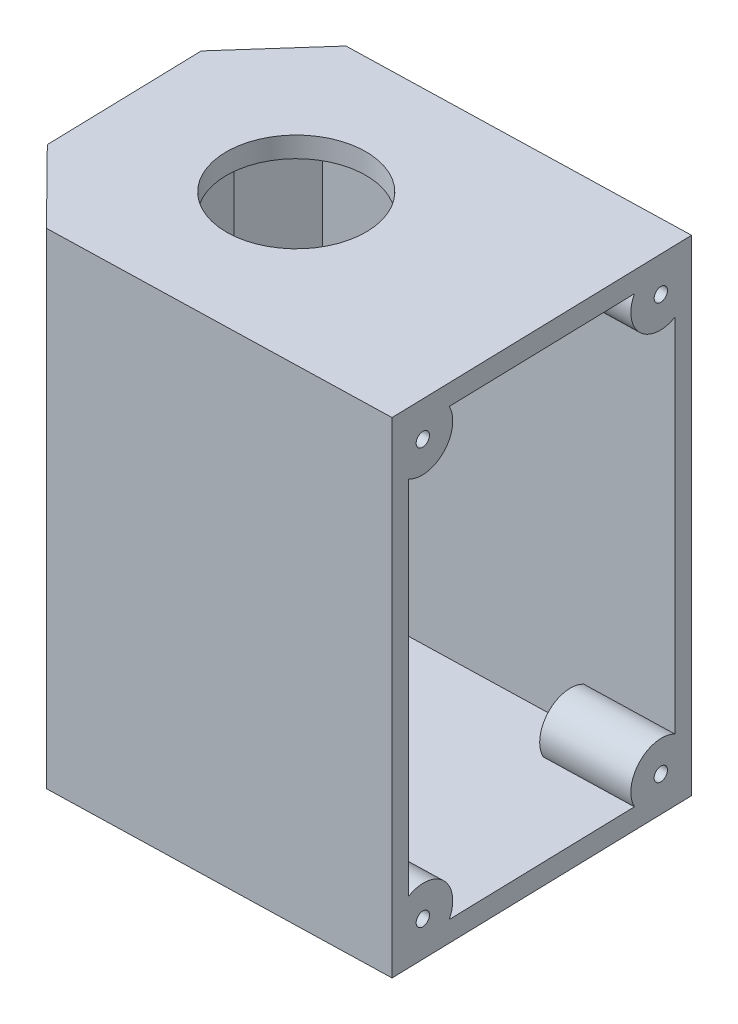
ISO-10303-21;
HEADER;
FILE_DESCRIPTION(('STEP AP214'),'2;1');
FILE_NAME('part.step','',(''),(''),'','','');
FILE_SCHEMA(('AUTOMOTIVE_DESIGN { 1 0 10303 214 1 1 1 1 }'));
ENDSEC;
DATA;
#1=APPLICATION_CONTEXT('core data for automotive mechanical design processes');
#2=APPLICATION_PROTOCOL_DEFINITION('international standard','automotive_design',2000,#1);
#3=PRODUCT_CONTEXT('',#1,'mechanical');
#4=PRODUCT('Part','Part','',(#3));
#5=PRODUCT_RELATED_PRODUCT_CATEGORY('part','',(#4));
#6=PRODUCT_DEFINITION_FORMATION('','',#4);
#7=PRODUCT_DEFINITION_CONTEXT('part definition',#1,'design');
#8=PRODUCT_DEFINITION('design','',#6,#7);
#9=PRODUCT_DEFINITION_SHAPE('','',#8);
#10=(LENGTH_UNIT() NAMED_UNIT(*) SI_UNIT(.MILLI.,.METRE.));
#11=(NAMED_UNIT(*) PLANE_ANGLE_UNIT() SI_UNIT($,.RADIAN.));
#12=(NAMED_UNIT(*) SI_UNIT($,.STERADIAN.) SOLID_ANGLE_UNIT());
#13=UNCERTAINTY_MEASURE_WITH_UNIT(LENGTH_MEASURE(1.E-05),#10,'distance_accuracy_value','');
#14=(GEOMETRIC_REPRESENTATION_CONTEXT(3) GLOBAL_UNCERTAINTY_ASSIGNED_CONTEXT((#13)) GLOBAL_UNIT_ASSIGNED_CONTEXT((#10,
#11,#12)) REPRESENTATION_CONTEXT('',''));
#15=CARTESIAN_POINT('',(0.,0.,0.));
#16=DIRECTION('',(0.,0.,1.));
#17=DIRECTION('',(1.,0.,0.));
#18=AXIS2_PLACEMENT_3D('',#15,#16,#17);
#19=CARTESIAN_POINT('',(0.,68.,0.));
#20=DIRECTION('',(0.,1.,0.));
#21=DIRECTION('',(0.,0.,1.));
#22=AXIS2_PLACEMENT_3D('',#19,#20,#21);
#23=PLANE('',#22);
#24=CARTESIAN_POINT('',(-17.8934203792558,68.,0.436006424415583));
#25=DIRECTION('',(0.,1.,0.));
#26=DIRECTION('',(0.,0.,1.));
#27=AXIS2_PLACEMENT_3D('',#24,#25,#26);
#28=CIRCLE('',#27,10.2);
#29=CARTESIAN_POINT('',(-17.8934203792558,68.,10.6360064244156));
#30=VERTEX_POINT('',#29);
#31=EDGE_CURVE('E322',#30,#30,#28,.F.);
#32=ORIENTED_EDGE('',*,*,#31,.F.);
#33=EDGE_LOOP('',(#32));
#34=FACE_BOUND('',#33,.T.);
#35=DIRECTION('',(-0.664307263992294,0.,0.747459603595454));
#36=VECTOR('',#35,1.);
#37=CARTESIAN_POINT('',(-28.3151559676767,68.,-25.1651911353096));
#38=LINE('',#37,#36);
#39=CARTESIAN_POINT('',(-33.6502390853678,68.,-19.1623076377953));
#40=VERTEX_POINT('',#39);
#41=CARTESIAN_POINT('',(-39.7506711500568,68.,-12.2982753142132));
#42=VERTEX_POINT('',#41);
#43=EDGE_CURVE('E185',#40,#42,#38,.T.);
#44=ORIENTED_EDGE('',*,*,#43,.F.);
#45=DIRECTION('',(0.999650770675558,0.,-0.0264260607689318));
#46=VECTOR('',#45,1.);
#47=CARTESIAN_POINT('',(-116.231008356699,68.,-16.9792608267229));
#48=LINE('',#47,#46);
#49=CARTESIAN_POINT('',(3.58326374035726,68.,-20.1465861850402));
#50=VERTEX_POINT('',#49);
#51=EDGE_CURVE('E192',#40,#50,#48,.T.);
#52=ORIENTED_EDGE('',*,*,#51,.T.);
#53=DIRECTION('',(-0.0264260607689318,0.,-0.999650770675558));
#54=VECTOR('',#53,1.);
#55=CARTESIAN_POINT('',(4.11297039872279,68.,-0.108727576555575));
#56=LINE('',#55,#54);
#57=CARTESIAN_POINT('',(3.74419705805505,68.,-14.0587656630687));
#58=VERTEX_POINT('',#57);
#59=EDGE_CURVE('E373',#58,#50,#56,.T.);
#60=ORIENTED_EDGE('',*,*,#59,.F.);
#61=DIRECTION('',(0.999650770675558,0.,-0.0264260607689318));
#62=VECTOR('',#61,1.);
#63=CARTESIAN_POINT('',(-49.1274945265591,68.,-12.6610870179285));
#64=LINE('',#63,#62);
#65=CARTESIAN_POINT('',(16.7396570768373,68.,-14.4023044530648));
#66=VERTEX_POINT('',#65);
#67=EDGE_CURVE('E258',#58,#66,#64,.T.);
#68=ORIENTED_EDGE('',*,*,#67,.T.);
#69=DIRECTION('',(0.0264260607689318,0.,0.999650770675558));
#70=VECTOR('',#69,1.);
#71=CARTESIAN_POINT('',(17.108430417505,68.,-0.452266366551688));
#72=LINE('',#71,#70);
#73=CARTESIAN_POINT('',(17.4752483112733,68.,13.4238006496144));
#74=VERTEX_POINT('',#73);
#75=EDGE_CURVE('E283',#66,#74,#72,.T.);
#76=ORIENTED_EDGE('',*,*,#75,.T.);
#77=DIRECTION('',(0.999650770675558,0.,-0.0264260607689318));
#78=VECTOR('',#77,1.);
#79=CARTESIAN_POINT('',(-48.3919032921231,68.,15.1650180847507));
#80=LINE('',#79,#78);
#81=CARTESIAN_POINT('',(4.479788292491,68.,13.7673394396105));
#82=VERTEX_POINT('',#81);
#83=EDGE_CURVE('E251',#82,#74,#80,.T.);
#84=ORIENTED_EDGE('',*,*,#83,.F.);
#85=CARTESIAN_POINT('',(4.64072161018879,68.,19.855159961582));
#86=VERTEX_POINT('',#85);
#87=EDGE_CURVE('E371',#86,#82,#56,.T.);
#88=ORIENTED_EDGE('',*,*,#87,.F.);
#89=DIRECTION('',(0.999650770675558,0.,-0.0264260607689318));
#90=VECTOR('',#89,1.);
#91=CARTESIAN_POINT('',(-115.173550486868,68.,23.0224853198993));
#92=LINE('',#91,#90);
#93=CARTESIAN_POINT('',(-32.5927812155363,68.,20.8394385088269));
#94=VERTEX_POINT('',#93);
#95=EDGE_CURVE('E210',#94,#86,#92,.T.);
#96=ORIENTED_EDGE('',*,*,#95,.F.);
#97=DIRECTION('',(0.702870473293746,0.,0.711317859871257));
#98=VECTOR('',#97,1.);
#99=CARTESIAN_POINT('',(-26.9100461971686,68.,26.5904709750769));
#100=LINE('',#99,#98);
#101=CARTESIAN_POINT('',(-39.0473449468371,68.,14.3073011745663));
#102=VERTEX_POINT('',#101);
#103=EDGE_CURVE('E329',#102,#94,#100,.T.);
#104=ORIENTED_EDGE('',*,*,#103,.F.);
#105=DIRECTION('',(0.0264260607689317,0.,0.999650770675558));
#106=VECTOR('',#105,1.);
#107=CARTESIAN_POINT('',(-39.3980303249972,68.,1.04149846535005));
#108=LINE('',#107,#106);
#109=EDGE_CURVE('E195',#42,#102,#108,.T.);
#110=ORIENTED_EDGE('',*,*,#109,.F.);
#111=EDGE_LOOP('',(#44,#52,#60,#68,#76,#84,#88,#96,#104,#110));
#112=FACE_BOUND('',#111,.T.);
#113=ADVANCED_FACE('F49',(#34,#112),#23,.F.);
#114=CARTESIAN_POINT('',(0.,3.,0.));
#115=DIRECTION('',(0.,1.,0.));
#116=DIRECTION('',(0.,0.,1.));
#117=AXIS2_PLACEMENT_3D('',#114,#115,#116);
#118=PLANE('',#117);
#119=CARTESIAN_POINT('',(-17.8934203792558,3.,0.436006424415583));
#120=DIRECTION('',(0.,1.,0.));
#121=DIRECTION('',(0.,0.,1.));
#122=AXIS2_PLACEMENT_3D('',#119,#120,#121);
#123=CIRCLE('',#122,4.5);
#124=CARTESIAN_POINT('',(-17.8934203792558,3.,4.93600642441559));
#125=VERTEX_POINT('',#124);
#126=EDGE_CURVE('E319',#125,#125,#123,.F.);
#127=ORIENTED_EDGE('',*,*,#126,.T.);
#128=EDGE_LOOP('',(#127));
#129=FACE_BOUND('',#128,.T.);
#130=DIRECTION('',(0.999650770675558,0.,-0.0264260607689318));
#131=VECTOR('',#130,1.);
#132=CARTESIAN_POINT('',(-116.231008356699,3.,-16.9792608267229));
#133=LINE('',#132,#131);
#134=CARTESIAN_POINT('',(-33.6502390853678,3.,-19.1623076377953));
#135=VERTEX_POINT('',#134);
#136=CARTESIAN_POINT('',(3.58326374035726,3.,-20.1465861850402));
#137=VERTEX_POINT('',#136);
#138=EDGE_CURVE('E203',#135,#137,#133,.T.);
#139=ORIENTED_EDGE('',*,*,#138,.F.);
#140=DIRECTION('',(-0.664307263992294,0.,0.747459603595454));
#141=VECTOR('',#140,1.);
#142=CARTESIAN_POINT('',(-28.3151559676767,3.,-25.1651911353096));
#143=LINE('',#142,#141);
#144=CARTESIAN_POINT('',(-39.7506711500568,3.,-12.2982753142132));
#145=VERTEX_POINT('',#144);
#146=EDGE_CURVE('E64',#135,#145,#143,.T.);
#147=ORIENTED_EDGE('',*,*,#146,.T.);
#148=DIRECTION('',(0.0264260607689317,0.,0.999650770675558));
#149=VECTOR('',#148,1.);
#150=CARTESIAN_POINT('',(-39.3980303249972,3.,1.04149846535005));
#151=LINE('',#150,#149);
#152=CARTESIAN_POINT('',(-39.0473449468371,3.,14.3073011745663));
#153=VERTEX_POINT('',#152);
#154=EDGE_CURVE('E274',#145,#153,#151,.T.);
#155=ORIENTED_EDGE('',*,*,#154,.T.);
#156=DIRECTION('',(0.702870473293746,0.,0.711317859871257));
#157=VECTOR('',#156,1.);
#158=CARTESIAN_POINT('',(-26.9100461971686,3.,26.5904709750769));
#159=LINE('',#158,#157);
#160=CARTESIAN_POINT('',(-32.5927812155363,3.,20.8394385088269));
#161=VERTEX_POINT('',#160);
#162=EDGE_CURVE('E330',#153,#161,#159,.T.);
#163=ORIENTED_EDGE('',*,*,#162,.T.);
#164=DIRECTION('',(0.999650770675558,0.,-0.0264260607689318));
#165=VECTOR('',#164,1.);
#166=CARTESIAN_POINT('',(-115.173550486868,3.,23.0224853198993));
#167=LINE('',#166,#165);
#168=CARTESIAN_POINT('',(4.64072161018879,3.,19.855159961582));
#169=VERTEX_POINT('',#168);
#170=EDGE_CURVE('E372',#161,#169,#167,.T.);
#171=ORIENTED_EDGE('',*,*,#170,.T.);
#172=DIRECTION('',(0.0264260607689318,0.,0.999650770675558));
#173=VECTOR('',#172,1.);
#174=CARTESIAN_POINT('',(4.11297039872279,3.,-0.108727576555575));
#175=LINE('',#174,#173);
#176=CARTESIAN_POINT('',(4.479788292491,3.,13.7673394396105));
#177=VERTEX_POINT('',#176);
#178=EDGE_CURVE('E318',#177,#169,#175,.T.);
#179=ORIENTED_EDGE('',*,*,#178,.F.);
#180=DIRECTION('',(0.999650770675558,0.,-0.0264260607689318));
#181=VECTOR('',#180,1.);
#182=CARTESIAN_POINT('',(-48.3919032921231,3.,15.1650180847507));
#183=LINE('',#182,#181);
#184=CARTESIAN_POINT('',(17.4752483112732,3.,13.4238006496144));
#185=VERTEX_POINT('',#184);
#186=EDGE_CURVE('E265',#177,#185,#183,.T.);
#187=ORIENTED_EDGE('',*,*,#186,.T.);
#188=DIRECTION('',(-0.0264260607689318,0.,-0.999650770675558));
#189=VECTOR('',#188,1.);
#190=CARTESIAN_POINT('',(17.636181628971,3.,19.5116211715859));
#191=LINE('',#190,#189);
#192=CARTESIAN_POINT('',(16.7396570768373,3.,-14.4023044530648));
#193=VERTEX_POINT('',#192);
#194=EDGE_CURVE('E296',#185,#193,#191,.T.);
#195=ORIENTED_EDGE('',*,*,#194,.T.);
#196=DIRECTION('',(0.999650770675558,0.,-0.0264260607689318));
#197=VECTOR('',#196,1.);
#198=CARTESIAN_POINT('',(-49.1274945265591,3.,-12.6610870179285));
#199=LINE('',#198,#197);
#200=CARTESIAN_POINT('',(3.74419705805505,3.,-14.0587656630687));
#201=VERTEX_POINT('',#200);
#202=EDGE_CURVE('E272',#201,#193,#199,.T.);
#203=ORIENTED_EDGE('',*,*,#202,.F.);
#204=DIRECTION('',(-0.0264260607689318,0.,-0.999650770675558));
#205=VECTOR('',#204,1.);
#206=CARTESIAN_POINT('',(4.11297039872279,3.,-0.108727576555575));
#207=LINE('',#206,#205);
#208=EDGE_CURVE('E207',#201,#137,#207,.T.);
#209=ORIENTED_EDGE('',*,*,#208,.T.);
#210=EDGE_LOOP('',(#139,#147,#155,#163,#171,#179,#187,#195,#203,#209));
#211=FACE_BOUND('',#210,.T.);
#212=ADVANCED_FACE('F404',(#129,#211),#118,.T.);
#213=CARTESIAN_POINT('',(-39.3980303249972,0.,1.04149846535005));
#214=DIRECTION('',(-0.999650770675558,0.,0.0264260607689317));
#215=DIRECTION('',(0.0264260607689317,0.,0.999650770675558));
#216=AXIS2_PLACEMENT_3D('',#213,#214,#215);
#217=PLANE('',#216);
#218=DIRECTION('',(0.,-1.,0.));
#219=VECTOR('',#218,1.);
#220=CARTESIAN_POINT('',(-39.7506711500568,0.,-12.2982753142132));
#221=LINE('',#220,#219);
#222=EDGE_CURVE('E196',#42,#145,#221,.T.);
#223=ORIENTED_EDGE('',*,*,#222,.F.);
#224=ORIENTED_EDGE('',*,*,#109,.T.);
#225=DIRECTION('',(0.,1.,0.));
#226=VECTOR('',#225,1.);
#227=CARTESIAN_POINT('',(-39.0473449468371,0.,14.3073011745663));
#228=LINE('',#227,#226);
#229=EDGE_CURVE('E57',#153,#102,#228,.T.);
#230=ORIENTED_EDGE('',*,*,#229,.F.);
#231=ORIENTED_EDGE('',*,*,#154,.F.);
#232=EDGE_LOOP('',(#223,#224,#230,#231));
#233=FACE_BOUND('',#232,.T.);
#234=ADVANCED_FACE('F333',(#233),#217,.F.);
#235=CARTESIAN_POINT('',(16.5787237591395,71.,-20.4901249750363));
#236=DIRECTION('',(0.0264260607689319,0.,0.999650770675558));
#237=DIRECTION('',(0.999650770675558,0.,-0.0264260607689319));
#238=AXIS2_PLACEMENT_3D('',#235,#236,#237);
#239=PLANE('',#238);
#240=ORIENTED_EDGE('',*,*,#51,.F.);
#241=DIRECTION('',(0.,-1.,0.));
#242=VECTOR('',#241,1.);
#243=CARTESIAN_POINT('',(-33.6502390853678,71.,-19.1623076377953));
#244=LINE('',#243,#242);
#245=EDGE_CURVE('E11',#40,#135,#244,.T.);
#246=ORIENTED_EDGE('',*,*,#245,.T.);
#247=ORIENTED_EDGE('',*,*,#138,.T.);
#248=DIRECTION('',(0.,-1.,0.));
#249=VECTOR('',#248,1.);
#250=CARTESIAN_POINT('',(3.58326374035726,0.,-20.1465861850402));
#251=LINE('',#250,#249);
#252=CARTESIAN_POINT('',(3.58326374035726,9.08994731015653,-20.1465861850402));
#253=VERTEX_POINT('',#252);
#254=EDGE_CURVE('E202',#253,#137,#251,.T.);
#255=ORIENTED_EDGE('',*,*,#254,.F.);
#256=DIRECTION('',(0.999650770675558,0.,-0.0264260607689318));
#257=VECTOR('',#256,1.);
#258=CARTESIAN_POINT('',(-49.2884278442568,9.08994731015653,-18.7489075399));
#259=LINE('',#258,#257);
#260=CARTESIAN_POINT('',(16.5787237591395,9.08994731015653,-20.4901249750363));
#261=VERTEX_POINT('',#260);
#262=EDGE_CURVE('E271',#253,#261,#259,.T.);
#263=ORIENTED_EDGE('',*,*,#262,.T.);
#264=DIRECTION('',(0.,-1.,0.));
#265=VECTOR('',#264,1.);
#266=CARTESIAN_POINT('',(16.5787237591395,71.,-20.4901249750363));
#267=LINE('',#266,#265);
#268=CARTESIAN_POINT('',(16.5787237591395,61.9100526898435,-20.4901249750363));
#269=VERTEX_POINT('',#268);
#270=EDGE_CURVE('E299',#269,#261,#267,.T.);
#271=ORIENTED_EDGE('',*,*,#270,.F.);
#272=DIRECTION('',(0.999650770675558,0.,-0.0264260607689318));
#273=VECTOR('',#272,1.);
#274=CARTESIAN_POINT('',(-49.2884278442568,61.9100526898435,-18.7489075399));
#275=LINE('',#274,#273);
#276=CARTESIAN_POINT('',(3.58326374035726,61.9100526898435,-20.1465861850402));
#277=VERTEX_POINT('',#276);
#278=EDGE_CURVE('E257',#277,#269,#275,.T.);
#279=ORIENTED_EDGE('',*,*,#278,.F.);
#280=EDGE_CURVE('E201',#50,#277,#251,.T.);
#281=ORIENTED_EDGE('',*,*,#280,.F.);
#282=EDGE_LOOP('',(#240,#246,#247,#255,#263,#271,#279,#281));
#283=FACE_BOUND('',#282,.T.);
#284=ADVANCED_FACE('F199',(#283),#239,.T.);
#285=CARTESIAN_POINT('',(-52.3655645176512,71.,21.3621378238682));
#286=DIRECTION('',(-0.026426060768932,0.,-0.999650770675558));
#287=DIRECTION('',(-0.999650770675558,0.,0.026426060768932));
#288=AXIS2_PLACEMENT_3D('',#285,#286,#287);
#289=PLANE('',#288);
#290=ORIENTED_EDGE('',*,*,#170,.F.);
#291=DIRECTION('',(0.,1.,0.));
#292=VECTOR('',#291,1.);
#293=CARTESIAN_POINT('',(-32.5927812155363,71.,20.8394385088269));
#294=LINE('',#293,#292);
#295=EDGE_CURVE('E71',#161,#94,#294,.T.);
#296=ORIENTED_EDGE('',*,*,#295,.T.);
#297=ORIENTED_EDGE('',*,*,#95,.T.);
#298=DIRECTION('',(0.,1.,0.));
#299=VECTOR('',#298,1.);
#300=CARTESIAN_POINT('',(4.64072161018879,0.,19.855159961582));
#301=LINE('',#300,#299);
#302=CARTESIAN_POINT('',(4.64072161018879,61.9100526898435,19.855159961582));
#303=VERTEX_POINT('',#302);
#304=EDGE_CURVE('E370',#303,#86,#301,.T.);
#305=ORIENTED_EDGE('',*,*,#304,.F.);
#306=DIRECTION('',(0.999650770675558,0.,-0.0264260607689318));
#307=VECTOR('',#306,1.);
#308=CARTESIAN_POINT('',(-48.2309699744253,61.9100526898435,21.2528386067222));
#309=LINE('',#308,#307);
#310=CARTESIAN_POINT('',(17.636181628971,61.9100526898435,19.5116211715859));
#311=VERTEX_POINT('',#310);
#312=EDGE_CURVE('E250',#303,#311,#309,.T.);
#313=ORIENTED_EDGE('',*,*,#312,.T.);
#314=DIRECTION('',(0.,-1.,0.));
#315=VECTOR('',#314,1.);
#316=CARTESIAN_POINT('',(17.636181628971,71.,19.5116211715859));
#317=LINE('',#316,#315);
#318=CARTESIAN_POINT('',(17.636181628971,9.08994731015653,19.5116211715859));
#319=VERTEX_POINT('',#318);
#320=EDGE_CURVE('E302',#311,#319,#317,.T.);
#321=ORIENTED_EDGE('',*,*,#320,.T.);
#322=DIRECTION('',(0.999650770675558,0.,-0.0264260607689318));
#323=VECTOR('',#322,1.);
#324=CARTESIAN_POINT('',(-48.2309699744253,9.08994731015653,21.2528386067222));
#325=LINE('',#324,#323);
#326=CARTESIAN_POINT('',(4.64072161018879,9.08994731015653,19.855159961582));
#327=VERTEX_POINT('',#326);
#328=EDGE_CURVE('E264',#327,#319,#325,.T.);
#329=ORIENTED_EDGE('',*,*,#328,.F.);
#330=EDGE_CURVE('E368',#169,#327,#301,.T.);
#331=ORIENTED_EDGE('',*,*,#330,.F.);
#332=EDGE_LOOP('',(#290,#296,#297,#305,#313,#321,#329,#331));
#333=FACE_BOUND('',#332,.T.);
#334=ADVANCED_FACE('F396',(#333),#289,.T.);
#335=CARTESIAN_POINT('',(0.,0.,0.));
#336=DIRECTION('',(0.,1.,0.));
#337=DIRECTION('',(0.,0.,1.));
#338=AXIS2_PLACEMENT_3D('',#335,#336,#337);
#339=PLANE('',#338);
#340=DIRECTION('',(0.664307263992294,0.,-0.747459603595454));
#341=VECTOR('',#340,1.);
#342=CARTESIAN_POINT('',(-29.0626155712721,0.,-25.8294983993019));
#343=LINE('',#342,#341);
#344=CARTESIAN_POINT('',(-42.7036780374664,0.,-10.4809636228995));
#345=VERTEX_POINT('',#344);
#346=CARTESIAN_POINT('',(-32.744156390403,0.,-21.6871335774113));
#347=VERTEX_POINT('',#346);
#348=EDGE_CURVE('E356',#345,#347,#343,.T.);
#349=ORIENTED_EDGE('',*,*,#348,.T.);
#350=DIRECTION('',(-0.999650770675558,0.,0.0264260607689319));
#351=VECTOR('',#350,1.);
#352=CARTESIAN_POINT('',(-55.9882144660939,0.,-21.0726700975206));
#353=LINE('',#352,#351);
#354=CARTESIAN_POINT('',(16.5126586072172,0.,-22.9892519017252));
#355=VERTEX_POINT('',#354);
#356=EDGE_CURVE('E312',#355,#347,#353,.T.);
#357=ORIENTED_EDGE('',*,*,#356,.F.);
#358=DIRECTION('',(-0.0264260607689318,0.,-0.999650770675558));
#359=VECTOR('',#358,1.);
#360=CARTESIAN_POINT('',(17.7022467808934,0.,22.0107480982748));
#361=LINE('',#360,#359);
#362=CARTESIAN_POINT('',(17.7022467808934,0.,22.0107480982748));
#363=VERTEX_POINT('',#362);
#364=EDGE_CURVE('E289',#363,#355,#361,.T.);
#365=ORIENTED_EDGE('',*,*,#364,.F.);
#366=DIRECTION('',(0.999650770675558,0.,-0.0264260607689319));
#367=VECTOR('',#366,1.);
#368=CARTESIAN_POINT('',(20.2013737075823,0.,21.9446829463524));
#369=LINE('',#368,#367);
#370=CARTESIAN_POINT('',(-31.5545682167268,0.,23.3128664225887));
#371=VERTEX_POINT('',#370);
#372=EDGE_CURVE('E310',#371,#363,#369,.T.);
#373=ORIENTED_EDGE('',*,*,#372,.F.);
#374=DIRECTION('',(0.702870473293746,0.,0.711317859871257));
#375=VECTOR('',#374,1.);
#376=CARTESIAN_POINT('',(-27.6213640570398,0.,27.2933414483706));
#377=LINE('',#376,#375);
#378=CARTESIAN_POINT('',(-42.0922426834808,0.,12.6485458478662));
#379=VERTEX_POINT('',#378);
#380=EDGE_CURVE('E350',#379,#371,#377,.T.);
#381=ORIENTED_EDGE('',*,*,#380,.F.);
#382=DIRECTION('',(0.0264260607689317,0.,0.999650770675558));
#383=VECTOR('',#382,1.);
#384=CARTESIAN_POINT('',(-42.9927544473117,0.,-21.4162088875167));
#385=LINE('',#384,#383);
#386=EDGE_CURVE('E277',#345,#379,#385,.T.);
#387=ORIENTED_EDGE('',*,*,#386,.F.);
#388=EDGE_LOOP('',(#349,#357,#365,#373,#381,#387));
#389=FACE_BOUND('',#388,.T.);
#390=CARTESIAN_POINT('',(-17.8934203792558,0.,0.436006424415583));
#391=DIRECTION('',(0.,-1.,0.));
#392=DIRECTION('',(0.,0.,-1.));
#393=AXIS2_PLACEMENT_3D('',#390,#391,#392);
#394=CIRCLE('',#393,4.5);
#395=CARTESIAN_POINT('',(-17.8934203792558,0.,-4.06399357558442));
#396=VERTEX_POINT('',#395);
#397=EDGE_CURVE('E321',#396,#396,#394,.T.);
#398=ORIENTED_EDGE('',*,*,#397,.F.);
#399=EDGE_LOOP('',(#398));
#400=FACE_BOUND('',#399,.T.);
#401=ADVANCED_FACE('F458',(#389,#400),#339,.F.);
#402=CARTESIAN_POINT('',(20.2013737075823,3.,21.9446829463524));
#403=DIRECTION('',(-0.0264260607689319,0.,-0.999650770675558));
#404=DIRECTION('',(-0.999650770675558,0.,0.0264260607689319));
#405=AXIS2_PLACEMENT_3D('',#402,#403,#404);
#406=PLANE('',#405);
#407=DIRECTION('',(0.,1.,0.));
#408=VECTOR('',#407,1.);
#409=CARTESIAN_POINT('',(-31.5545682167268,-125.999999999999,23.3128664225887));
#410=LINE('',#409,#408);
#411=CARTESIAN_POINT('',(-31.5545682167268,71.,23.3128664225887));
#412=VERTEX_POINT('',#411);
#413=EDGE_CURVE('E346',#371,#412,#410,.T.);
#414=ORIENTED_EDGE('',*,*,#413,.F.);
#415=ORIENTED_EDGE('',*,*,#372,.T.);
#416=DIRECTION('',(0.,-1.,0.));
#417=VECTOR('',#416,1.);
#418=CARTESIAN_POINT('',(17.7022467808934,71.,22.0107480982748));
#419=LINE('',#418,#417);
#420=CARTESIAN_POINT('',(17.7022467808934,71.,22.0107480982748));
#421=VERTEX_POINT('',#420);
#422=EDGE_CURVE('E286',#421,#363,#419,.T.);
#423=ORIENTED_EDGE('',*,*,#422,.F.);
#424=DIRECTION('',(0.999650770675558,0.,-0.0264260607689319));
#425=VECTOR('',#424,1.);
#426=CARTESIAN_POINT('',(-54.7986262924177,71.,23.9273299024794));
#427=LINE('',#426,#425);
#428=EDGE_CURVE('E305',#412,#421,#427,.T.);
#429=ORIENTED_EDGE('',*,*,#428,.F.);
#430=EDGE_LOOP('',(#414,#415,#423,#429));
#431=FACE_BOUND('',#430,.T.);
#432=ADVANCED_FACE('F51',(#431),#406,.F.);
#433=CARTESIAN_POINT('',(0.,71.,0.));
#434=DIRECTION('',(0.,1.,0.));
#435=DIRECTION('',(0.,0.,1.));
#436=AXIS2_PLACEMENT_3D('',#433,#434,#435);
#437=PLANE('',#436);
#438=DIRECTION('',(-0.999650770675558,0.,0.0264260607689319));
#439=VECTOR('',#438,1.);
#440=CARTESIAN_POINT('',(19.0117855339061,71.,-23.0553170536476));
#441=LINE('',#440,#439);
#442=CARTESIAN_POINT('',(16.5126586072172,71.,-22.9892519017252));
#443=VERTEX_POINT('',#442);
#444=CARTESIAN_POINT('',(-32.744156390403,71.,-21.6871335774113));
#445=VERTEX_POINT('',#444);
#446=EDGE_CURVE('E307',#443,#445,#441,.T.);
#447=ORIENTED_EDGE('',*,*,#446,.T.);
#448=DIRECTION('',(0.664307263992294,0.,-0.747459603595454));
#449=VECTOR('',#448,1.);
#450=CARTESIAN_POINT('',(-29.0626155712721,71.,-25.8294983993019));
#451=LINE('',#450,#449);
#452=CARTESIAN_POINT('',(-42.7036780374664,71.,-10.4809636228995));
#453=VERTEX_POINT('',#452);
#454=EDGE_CURVE('E343',#453,#445,#451,.T.);
#455=ORIENTED_EDGE('',*,*,#454,.F.);
#456=DIRECTION('',(-0.0264260607689317,0.,-0.999650770675558));
#457=VECTOR('',#456,1.);
#458=CARTESIAN_POINT('',(-41.8031662736355,71.,23.5837911124833));
#459=LINE('',#458,#457);
#460=CARTESIAN_POINT('',(-42.0922426834808,71.,12.6485458478662));
#461=VERTEX_POINT('',#460);
#462=EDGE_CURVE('E280',#461,#453,#459,.T.);
#463=ORIENTED_EDGE('',*,*,#462,.F.);
#464=DIRECTION('',(0.702870473293746,0.,0.711317859871257));
#465=VECTOR('',#464,1.);
#466=CARTESIAN_POINT('',(-27.6213640570398,71.,27.2933414483706));
#467=LINE('',#466,#465);
#468=EDGE_CURVE('E335',#461,#412,#467,.T.);
#469=ORIENTED_EDGE('',*,*,#468,.T.);
#470=ORIENTED_EDGE('',*,*,#428,.T.);
#471=DIRECTION('',(0.0264260607689318,0.,0.999650770675558));
#472=VECTOR('',#471,1.);
#473=CARTESIAN_POINT('',(16.5126586072172,71.,-22.9892519017252));
#474=LINE('',#473,#472);
#475=EDGE_CURVE('E293',#443,#421,#474,.T.);
#476=ORIENTED_EDGE('',*,*,#475,.F.);
#477=EDGE_LOOP('',(#447,#455,#463,#469,#470,#476));
#478=FACE_BOUND('',#477,.T.);
#479=CARTESIAN_POINT('',(-17.8934203792558,71.,0.436006424415583));
#480=DIRECTION('',(0.,1.,0.));
#481=DIRECTION('',(0.,0.,1.));
#482=AXIS2_PLACEMENT_3D('',#479,#480,#481);
#483=CIRCLE('',#482,10.2);
#484=CARTESIAN_POINT('',(-17.8934203792558,71.,10.6360064244156));
#485=VERTEX_POINT('',#484);
#486=EDGE_CURVE('E359',#485,#485,#483,.T.);
#487=ORIENTED_EDGE('',*,*,#486,.F.);
#488=EDGE_LOOP('',(#487));
#489=FACE_BOUND('',#488,.T.);
#490=ADVANCED_FACE('F459',(#478,#489),#437,.T.);
#491=CARTESIAN_POINT('',(-42.3969826370238,0.,1.12077664765685));
#492=DIRECTION('',(-0.999650770675558,0.,0.0264260607689317));
#493=DIRECTION('',(0.0264260607689317,0.,0.999650770675558));
#494=AXIS2_PLACEMENT_3D('',#491,#492,#493);
#495=PLANE('',#494);
#496=DIRECTION('',(0.,1.,0.));
#497=VECTOR('',#496,1.);
#498=CARTESIAN_POINT('',(-42.7036780374664,-125.999999999999,-10.4809636228995));
#499=LINE('',#498,#497);
#500=EDGE_CURVE('E345',#345,#453,#499,.T.);
#501=ORIENTED_EDGE('',*,*,#500,.F.);
#502=ORIENTED_EDGE('',*,*,#386,.T.);
#503=DIRECTION('',(0.,1.,0.));
#504=VECTOR('',#503,1.);
#505=CARTESIAN_POINT('',(-42.0922426834808,-125.999999999999,12.6485458478662));
#506=LINE('',#505,#504);
#507=EDGE_CURVE('E338',#379,#461,#506,.T.);
#508=ORIENTED_EDGE('',*,*,#507,.T.);
#509=ORIENTED_EDGE('',*,*,#462,.T.);
#510=EDGE_LOOP('',(#501,#502,#508,#509));
#511=FACE_BOUND('',#510,.T.);
#512=ADVANCED_FACE('F449',(#511),#495,.T.);
#513=CARTESIAN_POINT('',(-17.8934203792558,72.9999999999986,0.436006424415583));
#514=DIRECTION('',(0.,-1.,0.));
#515=DIRECTION('',(0.,0.,-1.));
#516=AXIS2_PLACEMENT_3D('',#513,#514,#515);
#517=CYLINDRICAL_SURFACE('',#516,4.5);
#518=ORIENTED_EDGE('',*,*,#397,.T.);
#519=EDGE_LOOP('',(#518));
#520=FACE_BOUND('',#519,.T.);
#521=ORIENTED_EDGE('',*,*,#126,.F.);
#522=EDGE_LOOP('',(#521));
#523=FACE_BOUND('',#522,.T.);
#524=ADVANCED_FACE('F466',(#520,#523),#517,.F.);
#525=CARTESIAN_POINT('',(-55.9882144660939,3.,-21.0726700975206));
#526=DIRECTION('',(0.0264260607689319,0.,0.999650770675558));
#527=DIRECTION('',(0.999650770675558,0.,-0.0264260607689319));
#528=AXIS2_PLACEMENT_3D('',#525,#526,#527);
#529=PLANE('',#528);
#530=ORIENTED_EDGE('',*,*,#356,.T.);
#531=DIRECTION('',(0.,1.,0.));
#532=VECTOR('',#531,1.);
#533=CARTESIAN_POINT('',(-32.744156390403,-125.999999999999,-21.6871335774113));
#534=LINE('',#533,#532);
#535=EDGE_CURVE('E347',#347,#445,#534,.T.);
#536=ORIENTED_EDGE('',*,*,#535,.T.);
#537=ORIENTED_EDGE('',*,*,#446,.F.);
#538=DIRECTION('',(0.,1.,0.));
#539=VECTOR('',#538,1.);
#540=CARTESIAN_POINT('',(16.5126586072172,0.,-22.9892519017252));
#541=LINE('',#540,#539);
#542=EDGE_CURVE('E291',#355,#443,#541,.T.);
#543=ORIENTED_EDGE('',*,*,#542,.F.);
#544=EDGE_LOOP('',(#530,#536,#537,#543));
#545=FACE_BOUND('',#544,.T.);
#546=ADVANCED_FACE('F453',(#545),#529,.F.);
#547=CARTESIAN_POINT('',(17.108430417505,0.,-0.452266366551688));
#548=DIRECTION('',(0.999650770675558,0.,-0.0264260607689318));
#549=DIRECTION('',(-0.0264260607689318,0.,-0.999650770675558));
#550=AXIS2_PLACEMENT_3D('',#547,#548,#549);
#551=PLANE('',#550);
#552=CARTESIAN_POINT('',(17.5801234886618,65.8786796564404,17.3910416552967));
#553=DIRECTION('',(0.999650770675558,0.,-0.0264260607689318));
#554=DIRECTION('',(-0.0264260607689318,0.,-0.999650770675558));
#555=AXIS2_PLACEMENT_3D('',#552,#553,#554);
#556=CIRCLE('',#555,4.5);
#557=EDGE_CURVE('E247',#311,#74,#556,.T.);
#558=ORIENTED_EDGE('',*,*,#557,.T.);
#559=ORIENTED_EDGE('',*,*,#75,.F.);
#560=CARTESIAN_POINT('',(16.6347818994488,65.8786796564404,-18.3695454587472));
#561=DIRECTION('',(0.999650770675558,0.,-0.0264260607689318));
#562=DIRECTION('',(-0.0264260607689318,0.,-0.999650770675558));
#563=AXIS2_PLACEMENT_3D('',#560,#561,#562);
#564=CIRCLE('',#563,4.5);
#565=EDGE_CURVE('E253',#269,#66,#564,.F.);
#566=ORIENTED_EDGE('',*,*,#565,.F.);
#567=ORIENTED_EDGE('',*,*,#270,.T.);
#568=CARTESIAN_POINT('',(16.6347818994488,5.12132034355964,-18.3695454587472));
#569=DIRECTION('',(0.999650770675558,0.,-0.0264260607689318));
#570=DIRECTION('',(-0.0264260607689318,0.,-0.999650770675558));
#571=AXIS2_PLACEMENT_3D('',#568,#569,#570);
#572=CIRCLE('',#571,4.5);
#573=EDGE_CURVE('E267',#261,#193,#572,.T.);
#574=ORIENTED_EDGE('',*,*,#573,.T.);
#575=ORIENTED_EDGE('',*,*,#194,.F.);
#576=CARTESIAN_POINT('',(17.5801234886618,5.12132034355964,17.3910416552967));
#577=DIRECTION('',(0.999650770675558,0.,-0.0264260607689318));
#578=DIRECTION('',(-0.0264260607689318,0.,-0.999650770675558));
#579=AXIS2_PLACEMENT_3D('',#576,#577,#578);
#580=CIRCLE('',#579,4.5);
#581=EDGE_CURVE('E260',#319,#185,#580,.F.);
#582=ORIENTED_EDGE('',*,*,#581,.F.);
#583=ORIENTED_EDGE('',*,*,#320,.F.);
#584=EDGE_LOOP('',(#558,#559,#566,#567,#574,#575,#582,#583));
#585=FACE_BOUND('',#584,.T.);
#586=ORIENTED_EDGE('',*,*,#475,.T.);
#587=ORIENTED_EDGE('',*,*,#422,.T.);
#588=ORIENTED_EDGE('',*,*,#364,.T.);
#589=ORIENTED_EDGE('',*,*,#542,.T.);
#590=EDGE_LOOP('',(#586,#587,#588,#589));
#591=FACE_BOUND('',#590,.T.);
#592=CARTESIAN_POINT('',(17.5801234886618,5.12132034355964,17.3910416552967));
#593=DIRECTION('',(0.999650770675558,0.,-0.0264260607689318));
#594=DIRECTION('',(-0.0264260607689318,0.,-0.999650770675558));
#595=AXIS2_PLACEMENT_3D('',#592,#593,#594);
#596=CIRCLE('',#595,1.);
#597=CARTESIAN_POINT('',(17.5536974278928,5.12132034355964,16.3913908846212));
#598=VERTEX_POINT('',#597);
#599=EDGE_CURVE('E244',#598,#598,#596,.T.);
#600=ORIENTED_EDGE('',*,*,#599,.F.);
#601=EDGE_LOOP('',(#600));
#602=FACE_BOUND('',#601,.T.);
#603=CARTESIAN_POINT('',(16.6347818994488,5.12132034355964,-18.3695454587472));
#604=DIRECTION('',(0.999650770675558,0.,-0.0264260607689318));
#605=DIRECTION('',(-0.0264260607689318,0.,-0.999650770675558));
#606=AXIS2_PLACEMENT_3D('',#603,#604,#605);
#607=CIRCLE('',#606,1.);
#608=CARTESIAN_POINT('',(16.6083558386799,5.12132034355964,-19.3691962294228));
#609=VERTEX_POINT('',#608);
#610=EDGE_CURVE('E241',#609,#609,#607,.T.);
#611=ORIENTED_EDGE('',*,*,#610,.F.);
#612=EDGE_LOOP('',(#611));
#613=FACE_BOUND('',#612,.T.);
#614=CARTESIAN_POINT('',(17.5801234886618,65.8786796564404,17.3910416552967));
#615=DIRECTION('',(0.999650770675558,0.,-0.0264260607689318));
#616=DIRECTION('',(-0.0264260607689318,0.,-0.999650770675558));
#617=AXIS2_PLACEMENT_3D('',#614,#615,#616);
#618=CIRCLE('',#617,1.);
#619=CARTESIAN_POINT('',(17.5536974278928,65.8786796564404,16.3913908846212));
#620=VERTEX_POINT('',#619);
#621=EDGE_CURVE('E238',#620,#620,#618,.T.);
#622=ORIENTED_EDGE('',*,*,#621,.F.);
#623=EDGE_LOOP('',(#622));
#624=FACE_BOUND('',#623,.T.);
#625=CARTESIAN_POINT('',(16.6347818994488,65.8786796564404,-18.3695454587472));
#626=DIRECTION('',(0.999650770675558,0.,-0.0264260607689318));
#627=DIRECTION('',(-0.0264260607689318,0.,-0.999650770675558));
#628=AXIS2_PLACEMENT_3D('',#625,#626,#627);
#629=CIRCLE('',#628,1.);
#630=CARTESIAN_POINT('',(16.6083558386799,65.8786796564404,-19.3691962294228));
#631=VERTEX_POINT('',#630);
#632=EDGE_CURVE('E235',#631,#631,#629,.T.);
#633=ORIENTED_EDGE('',*,*,#632,.F.);
#634=EDGE_LOOP('',(#633));
#635=FACE_BOUND('',#634,.T.);
#636=ADVANCED_FACE('F390',(#585,#591,#602,#613,#624,#635),#551,.T.);
#637=CARTESIAN_POINT('',(-49.2323697039476,5.12132034355964,-16.6283280236108));
#638=DIRECTION('',(0.999650770675558,0.,-0.0264260607689318));
#639=DIRECTION('',(-0.0264260607689318,0.,-0.999650770675558));
#640=AXIS2_PLACEMENT_3D('',#637,#638,#639);
#641=CYLINDRICAL_SURFACE('',#640,4.5);
#642=CARTESIAN_POINT('',(3.63932188066653,5.12132034355964,-18.0260066687511));
#643=DIRECTION('',(0.999650770675558,0.,-0.0264260607689318));
#644=DIRECTION('',(-0.0264260607689318,0.,-0.999650770675558));
#645=AXIS2_PLACEMENT_3D('',#642,#643,#644);
#646=CIRCLE('',#645,4.5);
#647=EDGE_CURVE('E232',#201,#253,#646,.F.);
#648=ORIENTED_EDGE('',*,*,#647,.F.);
#649=ORIENTED_EDGE('',*,*,#202,.T.);
#650=ORIENTED_EDGE('',*,*,#573,.F.);
#651=ORIENTED_EDGE('',*,*,#262,.F.);
#652=EDGE_LOOP('',(#648,#649,#650,#651));
#653=FACE_BOUND('',#652,.T.);
#654=ADVANCED_FACE('F411',(#653),#641,.T.);
#655=CARTESIAN_POINT('',(-48.2870281147346,5.12132034355964,19.1322590904331));
#656=DIRECTION('',(0.999650770675558,0.,-0.0264260607689318));
#657=DIRECTION('',(-0.0264260607689318,0.,-0.999650770675558));
#658=AXIS2_PLACEMENT_3D('',#655,#656,#657);
#659=CYLINDRICAL_SURFACE('',#658,4.5);
#660=ORIENTED_EDGE('',*,*,#186,.F.);
#661=CARTESIAN_POINT('',(4.58466346987951,5.12132034355964,17.7345804452929));
#662=DIRECTION('',(0.999650770675558,0.,-0.0264260607689318));
#663=DIRECTION('',(-0.0264260607689318,0.,-0.999650770675558));
#664=AXIS2_PLACEMENT_3D('',#661,#662,#663);
#665=CIRCLE('',#664,4.5);
#666=EDGE_CURVE('E229',#177,#327,#665,.T.);
#667=ORIENTED_EDGE('',*,*,#666,.T.);
#668=ORIENTED_EDGE('',*,*,#328,.T.);
#669=ORIENTED_EDGE('',*,*,#581,.T.);
#670=EDGE_LOOP('',(#660,#667,#668,#669));
#671=FACE_BOUND('',#670,.T.);
#672=ADVANCED_FACE('F400',(#671),#659,.T.);
#673=CARTESIAN_POINT('',(-49.2323697039476,65.8786796564404,-16.6283280236108));
#674=DIRECTION('',(0.999650770675558,0.,-0.0264260607689318));
#675=DIRECTION('',(-0.0264260607689318,0.,-0.999650770675558));
#676=AXIS2_PLACEMENT_3D('',#673,#674,#675);
#677=CYLINDRICAL_SURFACE('',#676,4.5);
#678=ORIENTED_EDGE('',*,*,#67,.F.);
#679=CARTESIAN_POINT('',(3.63932188066653,65.8786796564404,-18.0260066687511));
#680=DIRECTION('',(0.999650770675558,0.,-0.0264260607689318));
#681=DIRECTION('',(-0.0264260607689318,0.,-0.999650770675558));
#682=AXIS2_PLACEMENT_3D('',#679,#680,#681);
#683=CIRCLE('',#682,4.5);
#684=EDGE_CURVE('E226',#58,#277,#683,.T.);
#685=ORIENTED_EDGE('',*,*,#684,.T.);
#686=ORIENTED_EDGE('',*,*,#278,.T.);
#687=ORIENTED_EDGE('',*,*,#565,.T.);
#688=EDGE_LOOP('',(#678,#685,#686,#687));
#689=FACE_BOUND('',#688,.T.);
#690=ADVANCED_FACE('F417',(#689),#677,.T.);
#691=CARTESIAN_POINT('',(-48.2870281147346,65.8786796564404,19.1322590904331));
#692=DIRECTION('',(0.999650770675558,0.,-0.0264260607689318));
#693=DIRECTION('',(-0.0264260607689318,0.,-0.999650770675558));
#694=AXIS2_PLACEMENT_3D('',#691,#692,#693);
#695=CYLINDRICAL_SURFACE('',#694,4.5);
#696=CARTESIAN_POINT('',(4.58466346987951,65.8786796564404,17.7345804452929));
#697=DIRECTION('',(0.999650770675558,0.,-0.0264260607689318));
#698=DIRECTION('',(-0.0264260607689318,0.,-0.999650770675558));
#699=AXIS2_PLACEMENT_3D('',#696,#697,#698);
#700=CIRCLE('',#699,4.5);
#701=EDGE_CURVE('E223',#82,#303,#700,.F.);
#702=ORIENTED_EDGE('',*,*,#701,.F.);
#703=ORIENTED_EDGE('',*,*,#83,.T.);
#704=ORIENTED_EDGE('',*,*,#557,.F.);
#705=ORIENTED_EDGE('',*,*,#312,.F.);
#706=EDGE_LOOP('',(#702,#703,#704,#705));
#707=FACE_BOUND('',#706,.T.);
#708=ADVANCED_FACE('F387',(#707),#695,.T.);
#709=CARTESIAN_POINT('',(-43.1674962864187,5.12132034355964,18.996922767817));
#710=DIRECTION('',(0.999650770675558,0.,-0.0264260607689318));
#711=DIRECTION('',(-0.0264260607689318,0.,-0.999650770675558));
#712=AXIS2_PLACEMENT_3D('',#709,#710,#711);
#713=CYLINDRICAL_SURFACE('',#712,1.);
#714=CARTESIAN_POINT('',(4.5846634698795,5.12132034355964,17.7345804452929));
#715=DIRECTION('',(0.999650770675558,0.,-0.0264260607689318));
#716=DIRECTION('',(-0.0264260607689318,0.,-0.999650770675558));
#717=AXIS2_PLACEMENT_3D('',#714,#715,#716);
#718=CIRCLE('',#717,1.);
#719=CARTESIAN_POINT('',(4.55823740911057,5.12132034355964,16.7349296746173));
#720=VERTEX_POINT('',#719);
#721=EDGE_CURVE('E220',#720,#720,#718,.F.);
#722=ORIENTED_EDGE('',*,*,#721,.T.);
#723=EDGE_LOOP('',(#722));
#724=FACE_BOUND('',#723,.T.);
#725=ORIENTED_EDGE('',*,*,#599,.T.);
#726=EDGE_LOOP('',(#725));
#727=FACE_BOUND('',#726,.T.);
#728=ADVANCED_FACE('F579',(#724,#727),#713,.F.);
#729=CARTESIAN_POINT('',(-44.1128378756317,5.12132034355964,-16.7636643462269));
#730=DIRECTION('',(0.999650770675558,0.,-0.0264260607689318));
#731=DIRECTION('',(-0.0264260607689318,0.,-0.999650770675558));
#732=AXIS2_PLACEMENT_3D('',#729,#730,#731);
#733=CYLINDRICAL_SURFACE('',#732,1.);
#734=CARTESIAN_POINT('',(3.63932188066653,5.12132034355964,-18.0260066687511));
#735=DIRECTION('',(0.999650770675558,0.,-0.0264260607689318));
#736=DIRECTION('',(-0.0264260607689318,0.,-0.999650770675558));
#737=AXIS2_PLACEMENT_3D('',#734,#735,#736);
#738=CIRCLE('',#737,1.);
#739=CARTESIAN_POINT('',(3.61289581989759,5.12132034355964,-19.0256574394267));
#740=VERTEX_POINT('',#739);
#741=EDGE_CURVE('E216',#740,#740,#738,.F.);
#742=ORIENTED_EDGE('',*,*,#741,.T.);
#743=EDGE_LOOP('',(#742));
#744=FACE_BOUND('',#743,.T.);
#745=ORIENTED_EDGE('',*,*,#610,.T.);
#746=EDGE_LOOP('',(#745));
#747=FACE_BOUND('',#746,.T.);
#748=ADVANCED_FACE('F569',(#744,#747),#733,.F.);
#749=CARTESIAN_POINT('',(-43.1674962864187,65.8786796564404,18.996922767817));
#750=DIRECTION('',(0.999650770675558,0.,-0.0264260607689318));
#751=DIRECTION('',(-0.0264260607689318,0.,-0.999650770675558));
#752=AXIS2_PLACEMENT_3D('',#749,#750,#751);
#753=CYLINDRICAL_SURFACE('',#752,1.);
#754=CARTESIAN_POINT('',(4.5846634698795,65.8786796564404,17.7345804452929));
#755=DIRECTION('',(0.999650770675558,0.,-0.0264260607689318));
#756=DIRECTION('',(-0.0264260607689318,0.,-0.999650770675558));
#757=AXIS2_PLACEMENT_3D('',#754,#755,#756);
#758=CIRCLE('',#757,1.);
#759=CARTESIAN_POINT('',(4.55823740911057,65.8786796564404,16.7349296746173));
#760=VERTEX_POINT('',#759);
#761=EDGE_CURVE('E213',#760,#760,#758,.F.);
#762=ORIENTED_EDGE('',*,*,#761,.T.);
#763=EDGE_LOOP('',(#762));
#764=FACE_BOUND('',#763,.T.);
#765=ORIENTED_EDGE('',*,*,#621,.T.);
#766=EDGE_LOOP('',(#765));
#767=FACE_BOUND('',#766,.T.);
#768=ADVANCED_FACE('F429',(#764,#767),#753,.F.);
#769=CARTESIAN_POINT('',(-44.1128378756317,65.8786796564404,-16.7636643462269));
#770=DIRECTION('',(0.999650770675558,0.,-0.0264260607689318));
#771=DIRECTION('',(-0.0264260607689318,0.,-0.999650770675558));
#772=AXIS2_PLACEMENT_3D('',#769,#770,#771);
#773=CYLINDRICAL_SURFACE('',#772,1.);
#774=CARTESIAN_POINT('',(3.63932188066653,65.8786796564404,-18.0260066687511));
#775=DIRECTION('',(0.999650770675558,0.,-0.0264260607689318));
#776=DIRECTION('',(-0.0264260607689318,0.,-0.999650770675558));
#777=AXIS2_PLACEMENT_3D('',#774,#775,#776);
#778=CIRCLE('',#777,1.);
#779=CARTESIAN_POINT('',(3.61289581989759,65.8786796564404,-19.0256574394267));
#780=VERTEX_POINT('',#779);
#781=EDGE_CURVE('E217',#780,#780,#778,.F.);
#782=ORIENTED_EDGE('',*,*,#781,.T.);
#783=EDGE_LOOP('',(#782));
#784=FACE_BOUND('',#783,.T.);
#785=ORIENTED_EDGE('',*,*,#632,.T.);
#786=EDGE_LOOP('',(#785));
#787=FACE_BOUND('',#786,.T.);
#788=ADVANCED_FACE('F422',(#784,#787),#773,.F.);
#789=CARTESIAN_POINT('',(4.11297039872279,0.,-0.108727576555575));
#790=DIRECTION('',(0.999650770675558,0.,-0.0264260607689318));
#791=DIRECTION('',(-0.0264260607689318,0.,-0.999650770675558));
#792=AXIS2_PLACEMENT_3D('',#789,#790,#791);
#793=PLANE('',#792);
#794=ORIENTED_EDGE('',*,*,#781,.F.);
#795=EDGE_LOOP('',(#794));
#796=FACE_BOUND('',#795,.T.);
#797=ORIENTED_EDGE('',*,*,#59,.T.);
#798=ORIENTED_EDGE('',*,*,#280,.T.);
#799=ORIENTED_EDGE('',*,*,#684,.F.);
#800=EDGE_LOOP('',(#797,#798,#799));
#801=FACE_BOUND('',#800,.T.);
#802=ADVANCED_FACE('F420',(#796,#801),#793,.F.);
#803=ORIENTED_EDGE('',*,*,#701,.T.);
#804=ORIENTED_EDGE('',*,*,#304,.T.);
#805=ORIENTED_EDGE('',*,*,#87,.T.);
#806=EDGE_LOOP('',(#803,#804,#805));
#807=FACE_BOUND('',#806,.T.);
#808=ORIENTED_EDGE('',*,*,#761,.F.);
#809=EDGE_LOOP('',(#808));
#810=FACE_BOUND('',#809,.T.);
#811=ADVANCED_FACE('F379',(#807,#810),#793,.F.);
#812=ORIENTED_EDGE('',*,*,#647,.T.);
#813=ORIENTED_EDGE('',*,*,#254,.T.);
#814=ORIENTED_EDGE('',*,*,#208,.F.);
#815=EDGE_LOOP('',(#812,#813,#814));
#816=FACE_BOUND('',#815,.T.);
#817=ORIENTED_EDGE('',*,*,#741,.F.);
#818=EDGE_LOOP('',(#817));
#819=FACE_BOUND('',#818,.T.);
#820=ADVANCED_FACE('F413',(#816,#819),#793,.F.);
#821=ORIENTED_EDGE('',*,*,#721,.F.);
#822=EDGE_LOOP('',(#821));
#823=FACE_BOUND('',#822,.T.);
#824=ORIENTED_EDGE('',*,*,#178,.T.);
#825=ORIENTED_EDGE('',*,*,#330,.T.);
#826=ORIENTED_EDGE('',*,*,#666,.F.);
#827=EDGE_LOOP('',(#824,#825,#826));
#828=FACE_BOUND('',#827,.T.);
#829=ADVANCED_FACE('F403',(#823,#828),#793,.F.);
#830=CARTESIAN_POINT('',(-17.8934203792558,39.1500433275889,0.436006424415583));
#831=DIRECTION('',(0.,1.,0.));
#832=DIRECTION('',(0.,0.,1.));
#833=AXIS2_PLACEMENT_3D('',#830,#831,#832);
#834=CYLINDRICAL_SURFACE('',#833,10.2);
#835=ORIENTED_EDGE('',*,*,#31,.T.);
#836=EDGE_LOOP('',(#835));
#837=FACE_BOUND('',#836,.T.);
#838=ORIENTED_EDGE('',*,*,#486,.T.);
#839=EDGE_LOOP('',(#838));
#840=FACE_BOUND('',#839,.T.);
#841=ADVANCED_FACE('F436',(#837,#840),#834,.F.);
#842=CARTESIAN_POINT('',(-27.6213640570398,-125.999999999999,27.2933414483706));
#843=DIRECTION('',(-0.711317859871257,0.,0.702870473293746));
#844=DIRECTION('',(0.702870473293746,0.,0.711317859871257));
#845=AXIS2_PLACEMENT_3D('',#842,#843,#844);
#846=PLANE('',#845);
#847=ORIENTED_EDGE('',*,*,#380,.T.);
#848=ORIENTED_EDGE('',*,*,#413,.T.);
#849=ORIENTED_EDGE('',*,*,#468,.F.);
#850=ORIENTED_EDGE('',*,*,#507,.F.);
#851=EDGE_LOOP('',(#847,#848,#849,#850));
#852=FACE_BOUND('',#851,.T.);
#853=ADVANCED_FACE('F494',(#852),#846,.T.);
#854=CARTESIAN_POINT('',(-29.0626155712721,-125.999999999999,-25.8294983993019));
#855=DIRECTION('',(0.747459603595454,0.,0.664307263992294));
#856=DIRECTION('',(0.664307263992294,0.,-0.747459603595454));
#857=AXIS2_PLACEMENT_3D('',#854,#855,#856);
#858=PLANE('',#857);
#859=ORIENTED_EDGE('',*,*,#500,.T.);
#860=ORIENTED_EDGE('',*,*,#454,.T.);
#861=ORIENTED_EDGE('',*,*,#535,.F.);
#862=ORIENTED_EDGE('',*,*,#348,.F.);
#863=EDGE_LOOP('',(#859,#860,#861,#862));
#864=FACE_BOUND('',#863,.T.);
#865=ADVANCED_FACE('F482',(#864),#858,.F.);
#866=CARTESIAN_POINT('',(-26.9100461971686,0.,26.5904709750769));
#867=DIRECTION('',(-0.711317859871257,0.,0.702870473293746));
#868=DIRECTION('',(0.702870473293746,0.,0.711317859871257));
#869=AXIS2_PLACEMENT_3D('',#866,#867,#868);
#870=PLANE('',#869);
#871=ORIENTED_EDGE('',*,*,#229,.T.);
#872=ORIENTED_EDGE('',*,*,#103,.T.);
#873=ORIENTED_EDGE('',*,*,#295,.F.);
#874=ORIENTED_EDGE('',*,*,#162,.F.);
#875=EDGE_LOOP('',(#871,#872,#873,#874));
#876=FACE_BOUND('',#875,.T.);
#877=ADVANCED_FACE('F328',(#876),#870,.F.);
#878=CARTESIAN_POINT('',(-28.3151559676767,0.,-25.1651911353096));
#879=DIRECTION('',(-0.747459603595454,0.,-0.664307263992294));
#880=DIRECTION('',(-0.664307263992294,0.,0.747459603595454));
#881=AXIS2_PLACEMENT_3D('',#878,#879,#880);
#882=PLANE('',#881);
#883=ORIENTED_EDGE('',*,*,#43,.T.);
#884=ORIENTED_EDGE('',*,*,#222,.T.);
#885=ORIENTED_EDGE('',*,*,#146,.F.);
#886=ORIENTED_EDGE('',*,*,#245,.F.);
#887=EDGE_LOOP('',(#883,#884,#885,#886));
#888=FACE_BOUND('',#887,.T.);
#889=ADVANCED_FACE('F184',(#888),#882,.F.);
#890=CLOSED_SHELL('',(#113,#212,#234,#284,#334,#401,#432,#490,#512,#524,#546,#636,#654,#672,
#690,#708,#728,#748,#768,#788,#802,#811,#820,#829,#841,#853,#865,#877,#889));
#891=MANIFOLD_SOLID_BREP('B2',#890);
#892=ADVANCED_BREP_SHAPE_REPRESENTATION('',(#18,#891),#14);
#893=SHAPE_DEFINITION_REPRESENTATION(#9,#892);
ENDSEC;
END-ISO-10303-21;
